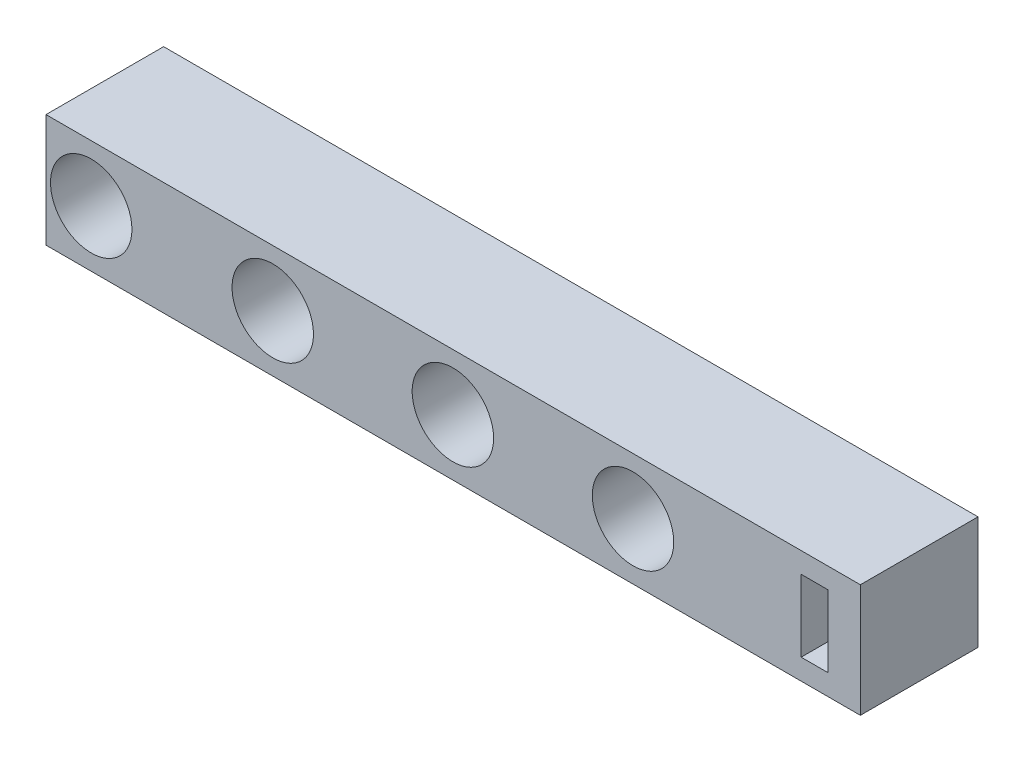
ISO-10303-21;
HEADER;
FILE_DESCRIPTION(('STEP AP214'),'2;1');
FILE_NAME('part.step','',(''),(''),'','','');
FILE_SCHEMA(('AUTOMOTIVE_DESIGN { 1 0 10303 214 1 1 1 1 }'));
ENDSEC;
DATA;
#1=APPLICATION_CONTEXT('core data for automotive mechanical design processes');
#2=APPLICATION_PROTOCOL_DEFINITION('international standard','automotive_design',2000,#1);
#3=PRODUCT_CONTEXT('',#1,'mechanical');
#4=PRODUCT('Part','Part','',(#3));
#5=PRODUCT_RELATED_PRODUCT_CATEGORY('part','',(#4));
#6=PRODUCT_DEFINITION_FORMATION('','',#4);
#7=PRODUCT_DEFINITION_CONTEXT('part definition',#1,'design');
#8=PRODUCT_DEFINITION('design','',#6,#7);
#9=PRODUCT_DEFINITION_SHAPE('','',#8);
#10=(LENGTH_UNIT() NAMED_UNIT(*) SI_UNIT(.MILLI.,.METRE.));
#11=(NAMED_UNIT(*) PLANE_ANGLE_UNIT() SI_UNIT($,.RADIAN.));
#12=(NAMED_UNIT(*) SI_UNIT($,.STERADIAN.) SOLID_ANGLE_UNIT());
#13=UNCERTAINTY_MEASURE_WITH_UNIT(LENGTH_MEASURE(1.E-05),#10,'distance_accuracy_value','');
#14=(GEOMETRIC_REPRESENTATION_CONTEXT(3) GLOBAL_UNCERTAINTY_ASSIGNED_CONTEXT((#13)) GLOBAL_UNIT_ASSIGNED_CONTEXT((#10,
#11,#12)) REPRESENTATION_CONTEXT('',''));
#15=CARTESIAN_POINT('',(0.,0.,0.));
#16=DIRECTION('',(0.,0.,1.));
#17=DIRECTION('',(1.,0.,0.));
#18=AXIS2_PLACEMENT_3D('',#15,#16,#17);
#19=CARTESIAN_POINT('',(0.,0.,26.));
#20=DIRECTION('',(1.,0.,0.));
#21=DIRECTION('',(0.,0.,-1.));
#22=AXIS2_PLACEMENT_3D('',#19,#20,#21);
#23=PLANE('',#22);
#24=DIRECTION('',(0.,-1.,0.));
#25=VECTOR('',#24,1.);
#26=CARTESIAN_POINT('',(0.,0.,0.));
#27=LINE('',#26,#25);
#28=CARTESIAN_POINT('',(0.,25.,0.));
#29=VERTEX_POINT('',#28);
#30=CARTESIAN_POINT('',(0.,0.,0.));
#31=VERTEX_POINT('',#30);
#32=EDGE_CURVE('E156',#29,#31,#27,.T.);
#33=ORIENTED_EDGE('',*,*,#32,.T.);
#34=DIRECTION('',(0.,0.,-1.));
#35=VECTOR('',#34,1.);
#36=CARTESIAN_POINT('',(0.,0.,26.));
#37=LINE('',#36,#35);
#38=CARTESIAN_POINT('',(0.,0.,26.));
#39=VERTEX_POINT('',#38);
#40=EDGE_CURVE('E11',#39,#31,#37,.T.);
#41=ORIENTED_EDGE('',*,*,#40,.F.);
#42=DIRECTION('',(0.,-1.,0.));
#43=VECTOR('',#42,1.);
#44=CARTESIAN_POINT('',(0.,0.,26.));
#45=LINE('',#44,#43);
#46=CARTESIAN_POINT('',(0.,25.,26.));
#47=VERTEX_POINT('',#46);
#48=EDGE_CURVE('E157',#47,#39,#45,.T.);
#49=ORIENTED_EDGE('',*,*,#48,.F.);
#50=DIRECTION('',(0.,0.,-1.));
#51=VECTOR('',#50,1.);
#52=CARTESIAN_POINT('',(0.,25.,26.));
#53=LINE('',#52,#51);
#54=EDGE_CURVE('E167',#47,#29,#53,.T.);
#55=ORIENTED_EDGE('',*,*,#54,.T.);
#56=EDGE_LOOP('',(#33,#41,#49,#55));
#57=FACE_BOUND('',#56,.T.);
#58=ADVANCED_FACE('F32',(#57),#23,.F.);
#59=CARTESIAN_POINT('',(0.,0.,26.));
#60=DIRECTION('',(0.,1.,0.));
#61=DIRECTION('',(0.,0.,1.));
#62=AXIS2_PLACEMENT_3D('',#59,#60,#61);
#63=PLANE('',#62);
#64=DIRECTION('',(1.,0.,0.));
#65=VECTOR('',#64,1.);
#66=CARTESIAN_POINT('',(0.,0.,0.));
#67=LINE('',#66,#65);
#68=CARTESIAN_POINT('',(180.,0.,0.));
#69=VERTEX_POINT('',#68);
#70=EDGE_CURVE('E170',#31,#69,#67,.T.);
#71=ORIENTED_EDGE('',*,*,#70,.T.);
#72=DIRECTION('',(0.,0.,-1.));
#73=VECTOR('',#72,1.);
#74=CARTESIAN_POINT('',(180.,0.,26.));
#75=LINE('',#74,#73);
#76=CARTESIAN_POINT('',(180.,0.,26.));
#77=VERTEX_POINT('',#76);
#78=EDGE_CURVE('E39',#77,#69,#75,.T.);
#79=ORIENTED_EDGE('',*,*,#78,.F.);
#80=DIRECTION('',(1.,0.,0.));
#81=VECTOR('',#80,1.);
#82=CARTESIAN_POINT('',(0.,0.,26.));
#83=LINE('',#82,#81);
#84=EDGE_CURVE('E160',#39,#77,#83,.T.);
#85=ORIENTED_EDGE('',*,*,#84,.F.);
#86=ORIENTED_EDGE('',*,*,#40,.T.);
#87=EDGE_LOOP('',(#71,#79,#85,#86));
#88=FACE_BOUND('',#87,.T.);
#89=ADVANCED_FACE('F199',(#88),#63,.F.);
#90=CARTESIAN_POINT('',(180.,0.,26.));
#91=DIRECTION('',(-1.,0.,0.));
#92=DIRECTION('',(0.,0.,1.));
#93=AXIS2_PLACEMENT_3D('',#90,#91,#92);
#94=PLANE('',#93);
#95=DIRECTION('',(0.,1.,0.));
#96=VECTOR('',#95,1.);
#97=CARTESIAN_POINT('',(180.,0.,0.));
#98=LINE('',#97,#96);
#99=CARTESIAN_POINT('',(180.,25.,0.));
#100=VERTEX_POINT('',#99);
#101=EDGE_CURVE('E172',#69,#100,#98,.T.);
#102=ORIENTED_EDGE('',*,*,#101,.T.);
#103=DIRECTION('',(0.,0.,-1.));
#104=VECTOR('',#103,1.);
#105=CARTESIAN_POINT('',(180.,25.,26.));
#106=LINE('',#105,#104);
#107=CARTESIAN_POINT('',(180.,25.,26.));
#108=VERTEX_POINT('',#107);
#109=EDGE_CURVE('E177',#108,#100,#106,.T.);
#110=ORIENTED_EDGE('',*,*,#109,.F.);
#111=DIRECTION('',(0.,1.,0.));
#112=VECTOR('',#111,1.);
#113=CARTESIAN_POINT('',(180.,0.,26.));
#114=LINE('',#113,#112);
#115=EDGE_CURVE('E163',#77,#108,#114,.T.);
#116=ORIENTED_EDGE('',*,*,#115,.F.);
#117=ORIENTED_EDGE('',*,*,#78,.T.);
#118=EDGE_LOOP('',(#102,#110,#116,#117));
#119=FACE_BOUND('',#118,.T.);
#120=ADVANCED_FACE('F184',(#119),#94,.F.);
#121=CARTESIAN_POINT('',(0.,25.,26.));
#122=DIRECTION('',(0.,-1.,0.));
#123=DIRECTION('',(0.,0.,-1.));
#124=AXIS2_PLACEMENT_3D('',#121,#122,#123);
#125=PLANE('',#124);
#126=DIRECTION('',(-1.,0.,0.));
#127=VECTOR('',#126,1.);
#128=CARTESIAN_POINT('',(0.,25.,0.));
#129=LINE('',#128,#127);
#130=EDGE_CURVE('E161',#100,#29,#129,.T.);
#131=ORIENTED_EDGE('',*,*,#130,.T.);
#132=ORIENTED_EDGE('',*,*,#54,.F.);
#133=DIRECTION('',(-1.,0.,0.));
#134=VECTOR('',#133,1.);
#135=CARTESIAN_POINT('',(0.,25.,26.));
#136=LINE('',#135,#134);
#137=EDGE_CURVE('E165',#108,#47,#136,.T.);
#138=ORIENTED_EDGE('',*,*,#137,.F.);
#139=ORIENTED_EDGE('',*,*,#109,.T.);
#140=EDGE_LOOP('',(#131,#132,#138,#139));
#141=FACE_BOUND('',#140,.T.);
#142=ADVANCED_FACE('F192',(#141),#125,.F.);
#143=CARTESIAN_POINT('',(0.,0.,26.));
#144=DIRECTION('',(0.,0.,-1.));
#145=DIRECTION('',(-1.,0.,0.));
#146=AXIS2_PLACEMENT_3D('',#143,#144,#145);
#147=PLANE('',#146);
#148=DIRECTION('',(-1.,0.,0.));
#149=VECTOR('',#148,1.);
#150=CARTESIAN_POINT('',(172.810723890188,20.4582947622352,26.));
#151=LINE('',#150,#149);
#152=CARTESIAN_POINT('',(172.810723890188,20.4582947622352,26.));
#153=VERTEX_POINT('',#152);
#154=CARTESIAN_POINT('',(166.913142675889,20.4582947622352,26.));
#155=VERTEX_POINT('',#154);
#156=EDGE_CURVE('E123',#153,#155,#151,.T.);
#157=ORIENTED_EDGE('',*,*,#156,.F.);
#158=DIRECTION('',(0.,1.,0.));
#159=VECTOR('',#158,1.);
#160=CARTESIAN_POINT('',(172.810723890188,20.4582947622352,26.));
#161=LINE('',#160,#159);
#162=CARTESIAN_POINT('',(172.810723890188,4.59099292376435,26.));
#163=VERTEX_POINT('',#162);
#164=EDGE_CURVE('E46',#163,#153,#161,.T.);
#165=ORIENTED_EDGE('',*,*,#164,.F.);
#166=DIRECTION('',(1.,0.,0.));
#167=VECTOR('',#166,1.);
#168=CARTESIAN_POINT('',(172.810723890188,4.59099292376435,26.));
#169=LINE('',#168,#167);
#170=CARTESIAN_POINT('',(166.913142675889,4.59099292376435,26.));
#171=VERTEX_POINT('',#170);
#172=EDGE_CURVE('E114',#171,#163,#169,.T.);
#173=ORIENTED_EDGE('',*,*,#172,.F.);
#174=DIRECTION('',(0.,-1.,0.));
#175=VECTOR('',#174,1.);
#176=CARTESIAN_POINT('',(166.913142675889,20.4582947622352,26.));
#177=LINE('',#176,#175);
#178=EDGE_CURVE('E117',#155,#171,#177,.T.);
#179=ORIENTED_EDGE('',*,*,#178,.F.);
#180=EDGE_LOOP('',(#157,#165,#173,#179));
#181=FACE_BOUND('',#180,.T.);
#182=CARTESIAN_POINT('',(9.99561826907186,12.5,26.));
#183=DIRECTION('',(0.,0.,1.));
#184=DIRECTION('',(1.,0.,0.));
#185=AXIS2_PLACEMENT_3D('',#182,#183,#184);
#186=CIRCLE('',#185,8.99999999999999);
#187=CARTESIAN_POINT('',(18.9956182690718,12.5,26.));
#188=VERTEX_POINT('',#187);
#189=EDGE_CURVE('E129',#188,#188,#186,.T.);
#190=ORIENTED_EDGE('',*,*,#189,.F.);
#191=EDGE_LOOP('',(#190));
#192=FACE_BOUND('',#191,.T.);
#193=CARTESIAN_POINT('',(50.1213030261893,12.5,26.));
#194=DIRECTION('',(0.,0.,1.));
#195=DIRECTION('',(1.,0.,0.));
#196=AXIS2_PLACEMENT_3D('',#193,#194,#195);
#197=CIRCLE('',#196,8.99999999999999);
#198=CARTESIAN_POINT('',(59.1213030261892,12.5,26.));
#199=VERTEX_POINT('',#198);
#200=EDGE_CURVE('E138',#199,#199,#197,.T.);
#201=ORIENTED_EDGE('',*,*,#200,.F.);
#202=EDGE_LOOP('',(#201));
#203=FACE_BOUND('',#202,.T.);
#204=CARTESIAN_POINT('',(89.934725645119,12.5,26.));
#205=DIRECTION('',(0.,0.,1.));
#206=DIRECTION('',(1.,0.,0.));
#207=AXIS2_PLACEMENT_3D('',#204,#205,#206);
#208=CIRCLE('',#207,8.99999999999999);
#209=CARTESIAN_POINT('',(98.934725645119,12.5,26.));
#210=VERTEX_POINT('',#209);
#211=EDGE_CURVE('E144',#210,#210,#208,.T.);
#212=ORIENTED_EDGE('',*,*,#211,.F.);
#213=EDGE_LOOP('',(#212));
#214=FACE_BOUND('',#213,.T.);
#215=CARTESIAN_POINT('',(129.748148264049,12.5,26.));
#216=DIRECTION('',(0.,0.,1.));
#217=DIRECTION('',(1.,0.,0.));
#218=AXIS2_PLACEMENT_3D('',#215,#216,#217);
#219=CIRCLE('',#218,8.99999999999998);
#220=CARTESIAN_POINT('',(138.748148264049,12.5,26.));
#221=VERTEX_POINT('',#220);
#222=EDGE_CURVE('E150',#221,#221,#219,.T.);
#223=ORIENTED_EDGE('',*,*,#222,.F.);
#224=EDGE_LOOP('',(#223));
#225=FACE_BOUND('',#224,.T.);
#226=ORIENTED_EDGE('',*,*,#48,.T.);
#227=ORIENTED_EDGE('',*,*,#84,.T.);
#228=ORIENTED_EDGE('',*,*,#115,.T.);
#229=ORIENTED_EDGE('',*,*,#137,.T.);
#230=EDGE_LOOP('',(#226,#227,#228,#229));
#231=FACE_BOUND('',#230,.T.);
#232=ADVANCED_FACE('F198',(#181,#192,#203,#214,#225,#231),#147,.F.);
#233=CARTESIAN_POINT('',(0.,0.,0.));
#234=DIRECTION('',(0.,0.,-1.));
#235=DIRECTION('',(-1.,0.,0.));
#236=AXIS2_PLACEMENT_3D('',#233,#234,#235);
#237=PLANE('',#236);
#238=DIRECTION('',(0.,1.,0.));
#239=VECTOR('',#238,1.);
#240=CARTESIAN_POINT('',(172.810723890188,20.4582947622352,0.));
#241=LINE('',#240,#239);
#242=CARTESIAN_POINT('',(172.810723890188,4.59099292376435,0.));
#243=VERTEX_POINT('',#242);
#244=CARTESIAN_POINT('',(172.810723890188,20.4582947622352,0.));
#245=VERTEX_POINT('',#244);
#246=EDGE_CURVE('E98',#243,#245,#241,.T.);
#247=ORIENTED_EDGE('',*,*,#246,.T.);
#248=DIRECTION('',(-1.,0.,0.));
#249=VECTOR('',#248,1.);
#250=CARTESIAN_POINT('',(172.810723890188,20.4582947622352,0.));
#251=LINE('',#250,#249);
#252=CARTESIAN_POINT('',(166.913142675889,20.4582947622352,0.));
#253=VERTEX_POINT('',#252);
#254=EDGE_CURVE('E107',#245,#253,#251,.T.);
#255=ORIENTED_EDGE('',*,*,#254,.T.);
#256=DIRECTION('',(0.,-1.,0.));
#257=VECTOR('',#256,1.);
#258=CARTESIAN_POINT('',(166.913142675889,20.4582947622352,0.));
#259=LINE('',#258,#257);
#260=CARTESIAN_POINT('',(166.913142675889,4.59099292376435,0.));
#261=VERTEX_POINT('',#260);
#262=EDGE_CURVE('E54',#253,#261,#259,.T.);
#263=ORIENTED_EDGE('',*,*,#262,.T.);
#264=DIRECTION('',(1.,0.,0.));
#265=VECTOR('',#264,1.);
#266=CARTESIAN_POINT('',(172.810723890188,4.59099292376435,0.));
#267=LINE('',#266,#265);
#268=EDGE_CURVE('E104',#261,#243,#267,.T.);
#269=ORIENTED_EDGE('',*,*,#268,.T.);
#270=EDGE_LOOP('',(#247,#255,#263,#269));
#271=FACE_BOUND('',#270,.T.);
#272=CARTESIAN_POINT('',(9.99561826907186,12.5,0.));
#273=DIRECTION('',(0.,0.,1.));
#274=DIRECTION('',(1.,0.,0.));
#275=AXIS2_PLACEMENT_3D('',#272,#273,#274);
#276=CIRCLE('',#275,8.99999999999999);
#277=CARTESIAN_POINT('',(18.9956182690718,12.5,0.));
#278=VERTEX_POINT('',#277);
#279=EDGE_CURVE('E135',#278,#278,#276,.T.);
#280=ORIENTED_EDGE('',*,*,#279,.T.);
#281=EDGE_LOOP('',(#280));
#282=FACE_BOUND('',#281,.T.);
#283=CARTESIAN_POINT('',(50.1213030261893,12.5,0.));
#284=DIRECTION('',(0.,0.,1.));
#285=DIRECTION('',(1.,0.,0.));
#286=AXIS2_PLACEMENT_3D('',#283,#284,#285);
#287=CIRCLE('',#286,8.99999999999999);
#288=CARTESIAN_POINT('',(59.1213030261892,12.5,0.));
#289=VERTEX_POINT('',#288);
#290=EDGE_CURVE('E141',#289,#289,#287,.T.);
#291=ORIENTED_EDGE('',*,*,#290,.T.);
#292=EDGE_LOOP('',(#291));
#293=FACE_BOUND('',#292,.T.);
#294=CARTESIAN_POINT('',(89.934725645119,12.5,0.));
#295=DIRECTION('',(0.,0.,1.));
#296=DIRECTION('',(1.,0.,0.));
#297=AXIS2_PLACEMENT_3D('',#294,#295,#296);
#298=CIRCLE('',#297,8.99999999999998);
#299=CARTESIAN_POINT('',(98.934725645119,12.5,0.));
#300=VERTEX_POINT('',#299);
#301=EDGE_CURVE('E147',#300,#300,#298,.T.);
#302=ORIENTED_EDGE('',*,*,#301,.T.);
#303=EDGE_LOOP('',(#302));
#304=FACE_BOUND('',#303,.T.);
#305=CARTESIAN_POINT('',(129.748148264049,12.5,0.));
#306=DIRECTION('',(0.,0.,1.));
#307=DIRECTION('',(1.,0.,0.));
#308=AXIS2_PLACEMENT_3D('',#305,#306,#307);
#309=CIRCLE('',#308,8.99999999999998);
#310=CARTESIAN_POINT('',(138.748148264049,12.5,0.));
#311=VERTEX_POINT('',#310);
#312=EDGE_CURVE('E153',#311,#311,#309,.T.);
#313=ORIENTED_EDGE('',*,*,#312,.T.);
#314=EDGE_LOOP('',(#313));
#315=FACE_BOUND('',#314,.T.);
#316=ORIENTED_EDGE('',*,*,#32,.F.);
#317=ORIENTED_EDGE('',*,*,#130,.F.);
#318=ORIENTED_EDGE('',*,*,#101,.F.);
#319=ORIENTED_EDGE('',*,*,#70,.F.);
#320=EDGE_LOOP('',(#316,#317,#318,#319));
#321=FACE_BOUND('',#320,.T.);
#322=ADVANCED_FACE('F111',(#271,#282,#293,#304,#315,#321),#237,.T.);
#323=CARTESIAN_POINT('',(129.748148264049,12.5,26.));
#324=DIRECTION('',(0.,0.,1.));
#325=DIRECTION('',(1.,0.,0.));
#326=AXIS2_PLACEMENT_3D('',#323,#324,#325);
#327=CYLINDRICAL_SURFACE('',#326,8.99999999999998);
#328=ORIENTED_EDGE('',*,*,#312,.F.);
#329=EDGE_LOOP('',(#328));
#330=FACE_BOUND('',#329,.T.);
#331=ORIENTED_EDGE('',*,*,#222,.T.);
#332=EDGE_LOOP('',(#331));
#333=FACE_BOUND('',#332,.T.);
#334=ADVANCED_FACE('F211',(#330,#333),#327,.F.);
#335=CARTESIAN_POINT('',(89.934725645119,12.5,26.));
#336=DIRECTION('',(0.,0.,1.));
#337=DIRECTION('',(1.,0.,0.));
#338=AXIS2_PLACEMENT_3D('',#335,#336,#337);
#339=CYLINDRICAL_SURFACE('',#338,8.99999999999999);
#340=ORIENTED_EDGE('',*,*,#301,.F.);
#341=EDGE_LOOP('',(#340));
#342=FACE_BOUND('',#341,.T.);
#343=ORIENTED_EDGE('',*,*,#211,.T.);
#344=EDGE_LOOP('',(#343));
#345=FACE_BOUND('',#344,.T.);
#346=ADVANCED_FACE('F217',(#342,#345),#339,.F.);
#347=CARTESIAN_POINT('',(50.1213030261893,12.5,26.));
#348=DIRECTION('',(0.,0.,1.));
#349=DIRECTION('',(1.,0.,0.));
#350=AXIS2_PLACEMENT_3D('',#347,#348,#349);
#351=CYLINDRICAL_SURFACE('',#350,8.99999999999999);
#352=ORIENTED_EDGE('',*,*,#290,.F.);
#353=EDGE_LOOP('',(#352));
#354=FACE_BOUND('',#353,.T.);
#355=ORIENTED_EDGE('',*,*,#200,.T.);
#356=EDGE_LOOP('',(#355));
#357=FACE_BOUND('',#356,.T.);
#358=ADVANCED_FACE('F221',(#354,#357),#351,.F.);
#359=CARTESIAN_POINT('',(9.99561826907186,12.5,26.));
#360=DIRECTION('',(0.,0.,1.));
#361=DIRECTION('',(1.,0.,0.));
#362=AXIS2_PLACEMENT_3D('',#359,#360,#361);
#363=CYLINDRICAL_SURFACE('',#362,8.99999999999999);
#364=ORIENTED_EDGE('',*,*,#279,.F.);
#365=EDGE_LOOP('',(#364));
#366=FACE_BOUND('',#365,.T.);
#367=ORIENTED_EDGE('',*,*,#189,.T.);
#368=EDGE_LOOP('',(#367));
#369=FACE_BOUND('',#368,.T.);
#370=ADVANCED_FACE('F225',(#366,#369),#363,.F.);
#371=CARTESIAN_POINT('',(172.810723890188,20.4582947622352,0.));
#372=DIRECTION('',(1.,0.,0.));
#373=DIRECTION('',(0.,0.,-1.));
#374=AXIS2_PLACEMENT_3D('',#371,#372,#373);
#375=PLANE('',#374);
#376=ORIENTED_EDGE('',*,*,#164,.T.);
#377=DIRECTION('',(0.,0.,1.));
#378=VECTOR('',#377,1.);
#379=CARTESIAN_POINT('',(172.810723890188,20.4582947622352,0.));
#380=LINE('',#379,#378);
#381=EDGE_CURVE('E94',#245,#153,#380,.T.);
#382=ORIENTED_EDGE('',*,*,#381,.F.);
#383=ORIENTED_EDGE('',*,*,#246,.F.);
#384=DIRECTION('',(0.,0.,1.));
#385=VECTOR('',#384,1.);
#386=CARTESIAN_POINT('',(172.810723890188,4.59099292376435,0.));
#387=LINE('',#386,#385);
#388=EDGE_CURVE('E127',#243,#163,#387,.T.);
#389=ORIENTED_EDGE('',*,*,#388,.T.);
#390=EDGE_LOOP('',(#376,#382,#383,#389));
#391=FACE_BOUND('',#390,.T.);
#392=ADVANCED_FACE('F96',(#391),#375,.F.);
#393=CARTESIAN_POINT('',(172.810723890188,4.59099292376435,0.));
#394=DIRECTION('',(0.,-1.,0.));
#395=DIRECTION('',(0.,0.,-1.));
#396=AXIS2_PLACEMENT_3D('',#393,#394,#395);
#397=PLANE('',#396);
#398=ORIENTED_EDGE('',*,*,#172,.T.);
#399=ORIENTED_EDGE('',*,*,#388,.F.);
#400=ORIENTED_EDGE('',*,*,#268,.F.);
#401=DIRECTION('',(0.,0.,1.));
#402=VECTOR('',#401,1.);
#403=CARTESIAN_POINT('',(166.913142675889,4.59099292376435,0.));
#404=LINE('',#403,#402);
#405=EDGE_CURVE('E130',#261,#171,#404,.T.);
#406=ORIENTED_EDGE('',*,*,#405,.T.);
#407=EDGE_LOOP('',(#398,#399,#400,#406));
#408=FACE_BOUND('',#407,.T.);
#409=ADVANCED_FACE('F232',(#408),#397,.F.);
#410=CARTESIAN_POINT('',(166.913142675889,20.4582947622352,0.));
#411=DIRECTION('',(-1.,0.,0.));
#412=DIRECTION('',(0.,0.,1.));
#413=AXIS2_PLACEMENT_3D('',#410,#411,#412);
#414=PLANE('',#413);
#415=ORIENTED_EDGE('',*,*,#178,.T.);
#416=ORIENTED_EDGE('',*,*,#405,.F.);
#417=ORIENTED_EDGE('',*,*,#262,.F.);
#418=DIRECTION('',(0.,0.,1.));
#419=VECTOR('',#418,1.);
#420=CARTESIAN_POINT('',(166.913142675889,20.4582947622352,0.));
#421=LINE('',#420,#419);
#422=EDGE_CURVE('E103',#253,#155,#421,.T.);
#423=ORIENTED_EDGE('',*,*,#422,.T.);
#424=EDGE_LOOP('',(#415,#416,#417,#423));
#425=FACE_BOUND('',#424,.T.);
#426=ADVANCED_FACE('F235',(#425),#414,.F.);
#427=CARTESIAN_POINT('',(172.810723890188,20.4582947622352,0.));
#428=DIRECTION('',(0.,1.,0.));
#429=DIRECTION('',(0.,0.,1.));
#430=AXIS2_PLACEMENT_3D('',#427,#428,#429);
#431=PLANE('',#430);
#432=ORIENTED_EDGE('',*,*,#156,.T.);
#433=ORIENTED_EDGE('',*,*,#422,.F.);
#434=ORIENTED_EDGE('',*,*,#254,.F.);
#435=ORIENTED_EDGE('',*,*,#381,.T.);
#436=EDGE_LOOP('',(#432,#433,#434,#435));
#437=FACE_BOUND('',#436,.T.);
#438=ADVANCED_FACE('F108',(#437),#431,.F.);
#439=CLOSED_SHELL('',(#58,#89,#120,#142,#232,#322,#334,#346,#358,#370,#392,#409,#426,#438));
#440=MANIFOLD_SOLID_BREP('B2',#439);
#441=ADVANCED_BREP_SHAPE_REPRESENTATION('',(#18,#440),#14);
#442=SHAPE_DEFINITION_REPRESENTATION(#9,#441);
ENDSEC;
END-ISO-10303-21;
